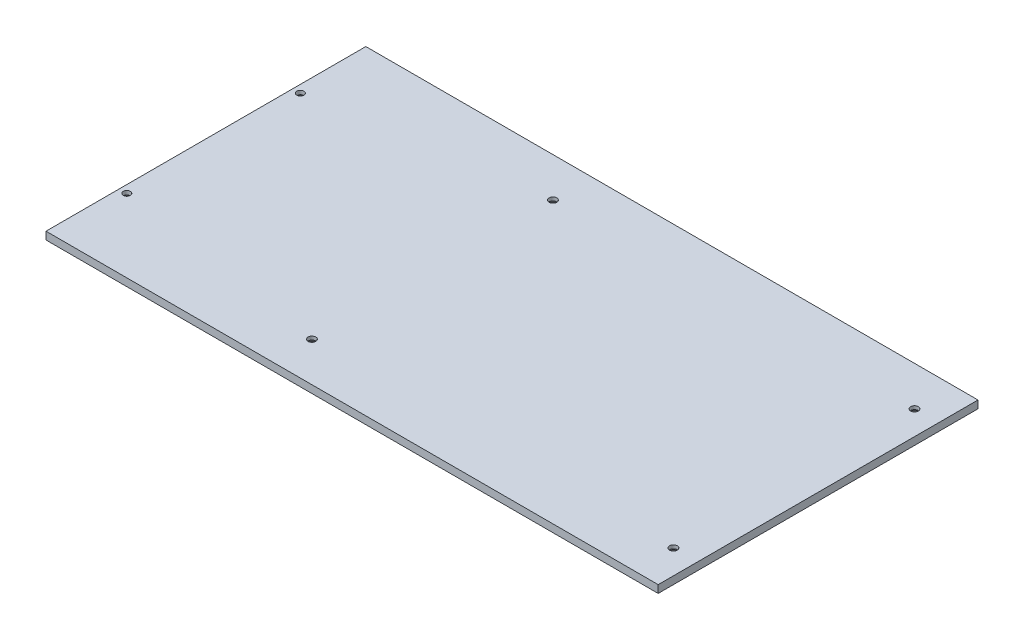
ISO-10303-21;
HEADER;
FILE_DESCRIPTION(('STEP AP214'),'2;1');
FILE_NAME('part.step','',(''),(''),'','','');
FILE_SCHEMA(('AUTOMOTIVE_DESIGN { 1 0 10303 214 1 1 1 1 }'));
ENDSEC;
DATA;
#1=APPLICATION_CONTEXT('core data for automotive mechanical design processes');
#2=APPLICATION_PROTOCOL_DEFINITION('international standard','automotive_design',2000,#1);
#3=PRODUCT_CONTEXT('',#1,'mechanical');
#4=PRODUCT('Part','Part','',(#3));
#5=PRODUCT_RELATED_PRODUCT_CATEGORY('part','',(#4));
#6=PRODUCT_DEFINITION_FORMATION('','',#4);
#7=PRODUCT_DEFINITION_CONTEXT('part definition',#1,'design');
#8=PRODUCT_DEFINITION('design','',#6,#7);
#9=PRODUCT_DEFINITION_SHAPE('','',#8);
#10=(LENGTH_UNIT() NAMED_UNIT(*) SI_UNIT(.MILLI.,.METRE.));
#11=(NAMED_UNIT(*) PLANE_ANGLE_UNIT() SI_UNIT($,.RADIAN.));
#12=(NAMED_UNIT(*) SI_UNIT($,.STERADIAN.) SOLID_ANGLE_UNIT());
#13=UNCERTAINTY_MEASURE_WITH_UNIT(LENGTH_MEASURE(1.E-05),#10,'distance_accuracy_value','');
#14=(GEOMETRIC_REPRESENTATION_CONTEXT(3) GLOBAL_UNCERTAINTY_ASSIGNED_CONTEXT((#13)) GLOBAL_UNIT_ASSIGNED_CONTEXT((#10,
#11,#12)) REPRESENTATION_CONTEXT('',''));
#15=CARTESIAN_POINT('',(0.,0.,0.));
#16=DIRECTION('',(0.,0.,1.));
#17=DIRECTION('',(1.,0.,0.));
#18=AXIS2_PLACEMENT_3D('',#15,#16,#17);
#19=CARTESIAN_POINT('',(0.,3.175,0.));
#20=DIRECTION('',(1.,0.,0.));
#21=DIRECTION('',(0.,0.,-1.));
#22=AXIS2_PLACEMENT_3D('',#19,#20,#21);
#23=PLANE('',#22);
#24=DIRECTION('',(0.,0.,1.));
#25=VECTOR('',#24,1.);
#26=CARTESIAN_POINT('',(0.,0.,0.));
#27=LINE('',#26,#25);
#28=CARTESIAN_POINT('',(0.,0.,-132.70000003));
#29=VERTEX_POINT('',#28);
#30=CARTESIAN_POINT('',(0.,0.,0.));
#31=VERTEX_POINT('',#30);
#32=EDGE_CURVE('E112',#29,#31,#27,.T.);
#33=ORIENTED_EDGE('',*,*,#32,.T.);
#34=DIRECTION('',(0.,-1.,0.));
#35=VECTOR('',#34,1.);
#36=CARTESIAN_POINT('',(0.,3.175,0.));
#37=LINE('',#36,#35);
#38=CARTESIAN_POINT('',(0.,3.175,0.));
#39=VERTEX_POINT('',#38);
#40=EDGE_CURVE('E11',#39,#31,#37,.T.);
#41=ORIENTED_EDGE('',*,*,#40,.F.);
#42=DIRECTION('',(0.,0.,1.));
#43=VECTOR('',#42,1.);
#44=CARTESIAN_POINT('',(0.,3.175,0.));
#45=LINE('',#44,#43);
#46=CARTESIAN_POINT('',(0.,3.175,-132.70000003));
#47=VERTEX_POINT('',#46);
#48=EDGE_CURVE('E99',#47,#39,#45,.T.);
#49=ORIENTED_EDGE('',*,*,#48,.F.);
#50=DIRECTION('',(0.,-1.,0.));
#51=VECTOR('',#50,1.);
#52=CARTESIAN_POINT('',(0.,3.175,-132.70000003));
#53=LINE('',#52,#51);
#54=EDGE_CURVE('E108',#47,#29,#53,.T.);
#55=ORIENTED_EDGE('',*,*,#54,.T.);
#56=EDGE_LOOP('',(#33,#41,#49,#55));
#57=FACE_BOUND('',#56,.T.);
#58=ADVANCED_FACE('F46',(#57),#23,.F.);
#59=CARTESIAN_POINT('',(0.,3.175,0.));
#60=DIRECTION('',(0.,0.,-1.));
#61=DIRECTION('',(-1.,0.,0.));
#62=AXIS2_PLACEMENT_3D('',#59,#60,#61);
#63=PLANE('',#62);
#64=DIRECTION('',(1.,0.,0.));
#65=VECTOR('',#64,1.);
#66=CARTESIAN_POINT('',(0.,0.,0.));
#67=LINE('',#66,#65);
#68=CARTESIAN_POINT('',(254.,0.,0.));
#69=VERTEX_POINT('',#68);
#70=EDGE_CURVE('E103',#31,#69,#67,.T.);
#71=ORIENTED_EDGE('',*,*,#70,.T.);
#72=DIRECTION('',(0.,-1.,0.));
#73=VECTOR('',#72,1.);
#74=CARTESIAN_POINT('',(254.,3.175,0.));
#75=LINE('',#74,#73);
#76=CARTESIAN_POINT('',(254.,3.175,0.));
#77=VERTEX_POINT('',#76);
#78=EDGE_CURVE('E55',#77,#69,#75,.T.);
#79=ORIENTED_EDGE('',*,*,#78,.F.);
#80=DIRECTION('',(1.,0.,0.));
#81=VECTOR('',#80,1.);
#82=CARTESIAN_POINT('',(0.,3.175,0.));
#83=LINE('',#82,#81);
#84=EDGE_CURVE('E94',#39,#77,#83,.T.);
#85=ORIENTED_EDGE('',*,*,#84,.F.);
#86=ORIENTED_EDGE('',*,*,#40,.T.);
#87=EDGE_LOOP('',(#71,#79,#85,#86));
#88=FACE_BOUND('',#87,.T.);
#89=ADVANCED_FACE('F102',(#88),#63,.F.);
#90=CARTESIAN_POINT('',(254.,3.175,0.));
#91=DIRECTION('',(-1.,0.,0.));
#92=DIRECTION('',(0.,0.,1.));
#93=AXIS2_PLACEMENT_3D('',#90,#91,#92);
#94=PLANE('',#93);
#95=DIRECTION('',(0.,0.,-1.));
#96=VECTOR('',#95,1.);
#97=CARTESIAN_POINT('',(254.,0.,0.));
#98=LINE('',#97,#96);
#99=CARTESIAN_POINT('',(254.,0.,-132.70000003));
#100=VERTEX_POINT('',#99);
#101=EDGE_CURVE('E81',#69,#100,#98,.T.);
#102=ORIENTED_EDGE('',*,*,#101,.T.);
#103=DIRECTION('',(0.,-1.,0.));
#104=VECTOR('',#103,1.);
#105=CARTESIAN_POINT('',(254.,3.175,-132.70000003));
#106=LINE('',#105,#104);
#107=CARTESIAN_POINT('',(254.,3.175,-132.70000003));
#108=VERTEX_POINT('',#107);
#109=EDGE_CURVE('E104',#108,#100,#106,.T.);
#110=ORIENTED_EDGE('',*,*,#109,.F.);
#111=DIRECTION('',(0.,0.,-1.));
#112=VECTOR('',#111,1.);
#113=CARTESIAN_POINT('',(254.,3.175,0.));
#114=LINE('',#113,#112);
#115=EDGE_CURVE('E97',#77,#108,#114,.T.);
#116=ORIENTED_EDGE('',*,*,#115,.F.);
#117=ORIENTED_EDGE('',*,*,#78,.T.);
#118=EDGE_LOOP('',(#102,#110,#116,#117));
#119=FACE_BOUND('',#118,.T.);
#120=ADVANCED_FACE('F106',(#119),#94,.F.);
#121=CARTESIAN_POINT('',(0.,3.175,-132.70000003));
#122=DIRECTION('',(0.,0.,1.));
#123=DIRECTION('',(1.,0.,0.));
#124=AXIS2_PLACEMENT_3D('',#121,#122,#123);
#125=PLANE('',#124);
#126=DIRECTION('',(-1.,0.,0.));
#127=VECTOR('',#126,1.);
#128=CARTESIAN_POINT('',(0.,0.,-132.70000003));
#129=LINE('',#128,#127);
#130=EDGE_CURVE('E87',#100,#29,#129,.T.);
#131=ORIENTED_EDGE('',*,*,#130,.T.);
#132=ORIENTED_EDGE('',*,*,#54,.F.);
#133=DIRECTION('',(-1.,0.,0.));
#134=VECTOR('',#133,1.);
#135=CARTESIAN_POINT('',(0.,3.175,-132.70000003));
#136=LINE('',#135,#134);
#137=EDGE_CURVE('E64',#108,#47,#136,.T.);
#138=ORIENTED_EDGE('',*,*,#137,.F.);
#139=ORIENTED_EDGE('',*,*,#109,.T.);
#140=EDGE_LOOP('',(#131,#132,#138,#139));
#141=FACE_BOUND('',#140,.T.);
#142=ADVANCED_FACE('F187',(#141),#125,.F.);
#143=CARTESIAN_POINT('',(0.,3.175,0.));
#144=DIRECTION('',(0.,-1.,0.));
#145=DIRECTION('',(0.,0.,-1.));
#146=AXIS2_PLACEMENT_3D('',#143,#144,#145);
#147=PLANE('',#146);
#148=CARTESIAN_POINT('',(3.17499999999969,3.175,-102.350000024));
#149=DIRECTION('',(0.,-1.,0.));
#150=DIRECTION('',(0.,0.,-1.));
#151=AXIS2_PLACEMENT_3D('',#148,#149,#150);
#152=CIRCLE('',#151,1.4732);
#153=CARTESIAN_POINT('',(3.17499999999969,3.175,-103.823200024));
#154=VERTEX_POINT('',#153);
#155=EDGE_CURVE('E49',#154,#154,#152,.T.);
#156=ORIENTED_EDGE('',*,*,#155,.T.);
#157=EDGE_LOOP('',(#156));
#158=FACE_BOUND('',#157,.T.);
#159=CARTESIAN_POINT('',(3.17499999999994,3.175,-30.350000006));
#160=DIRECTION('',(0.,-1.,0.));
#161=DIRECTION('',(0.,0.,-1.));
#162=AXIS2_PLACEMENT_3D('',#159,#160,#161);
#163=CIRCLE('',#162,1.4732);
#164=CARTESIAN_POINT('',(3.17499999999994,3.175,-31.823200006));
#165=VERTEX_POINT('',#164);
#166=EDGE_CURVE('E138',#165,#165,#163,.T.);
#167=ORIENTED_EDGE('',*,*,#166,.T.);
#168=EDGE_LOOP('',(#167));
#169=FACE_BOUND('',#168,.T.);
#170=CARTESIAN_POINT('',(244.,3.175,-116.350000015));
#171=DIRECTION('',(0.,-1.,0.));
#172=DIRECTION('',(0.,0.,-1.));
#173=AXIS2_PLACEMENT_3D('',#170,#171,#172);
#174=CIRCLE('',#173,1.59999999999999);
#175=CARTESIAN_POINT('',(244.,3.175,-117.950000015));
#176=VERTEX_POINT('',#175);
#177=EDGE_CURVE('E134',#176,#176,#174,.T.);
#178=ORIENTED_EDGE('',*,*,#177,.T.);
#179=EDGE_LOOP('',(#178));
#180=FACE_BOUND('',#179,.T.);
#181=CARTESIAN_POINT('',(94.,3.175,-116.350000015));
#182=DIRECTION('',(0.,-1.,0.));
#183=DIRECTION('',(0.,0.,-1.));
#184=AXIS2_PLACEMENT_3D('',#181,#182,#183);
#185=CIRCLE('',#184,1.6);
#186=CARTESIAN_POINT('',(94.,3.175,-117.950000015));
#187=VERTEX_POINT('',#186);
#188=EDGE_CURVE('E129',#187,#187,#185,.T.);
#189=ORIENTED_EDGE('',*,*,#188,.T.);
#190=EDGE_LOOP('',(#189));
#191=FACE_BOUND('',#190,.T.);
#192=CARTESIAN_POINT('',(94.,3.175,-16.350000015));
#193=DIRECTION('',(0.,-1.,0.));
#194=DIRECTION('',(0.,0.,-1.));
#195=AXIS2_PLACEMENT_3D('',#192,#193,#194);
#196=CIRCLE('',#195,1.6);
#197=CARTESIAN_POINT('',(94.,3.175,-17.950000015));
#198=VERTEX_POINT('',#197);
#199=EDGE_CURVE('E124',#198,#198,#196,.T.);
#200=ORIENTED_EDGE('',*,*,#199,.T.);
#201=EDGE_LOOP('',(#200));
#202=FACE_BOUND('',#201,.T.);
#203=CARTESIAN_POINT('',(244.,3.175,-16.350000015));
#204=DIRECTION('',(0.,-1.,0.));
#205=DIRECTION('',(0.,0.,-1.));
#206=AXIS2_PLACEMENT_3D('',#203,#204,#205);
#207=CIRCLE('',#206,1.59999999999999);
#208=CARTESIAN_POINT('',(244.,3.175,-17.950000015));
#209=VERTEX_POINT('',#208);
#210=EDGE_CURVE('E115',#209,#209,#207,.T.);
#211=ORIENTED_EDGE('',*,*,#210,.T.);
#212=EDGE_LOOP('',(#211));
#213=FACE_BOUND('',#212,.T.);
#214=ORIENTED_EDGE('',*,*,#48,.T.);
#215=ORIENTED_EDGE('',*,*,#84,.T.);
#216=ORIENTED_EDGE('',*,*,#115,.T.);
#217=ORIENTED_EDGE('',*,*,#137,.T.);
#218=EDGE_LOOP('',(#214,#215,#216,#217));
#219=FACE_BOUND('',#218,.T.);
#220=ADVANCED_FACE('F95',(#158,#169,#180,#191,#202,#213,#219),#147,.F.);
#221=CARTESIAN_POINT('',(0.,0.,0.));
#222=DIRECTION('',(0.,-1.,0.));
#223=DIRECTION('',(0.,0.,-1.));
#224=AXIS2_PLACEMENT_3D('',#221,#222,#223);
#225=PLANE('',#224);
#226=CARTESIAN_POINT('',(3.17499999999969,0.,-102.350000024));
#227=DIRECTION('',(0.,-1.,0.));
#228=DIRECTION('',(0.,0.,-1.));
#229=AXIS2_PLACEMENT_3D('',#226,#227,#228);
#230=CIRCLE('',#229,2.8575);
#231=CARTESIAN_POINT('',(3.17499999999969,0.,-105.207500024));
#232=VERTEX_POINT('',#231);
#233=EDGE_CURVE('E423',#232,#232,#230,.T.);
#234=ORIENTED_EDGE('',*,*,#233,.F.);
#235=EDGE_LOOP('',(#234));
#236=FACE_BOUND('',#235,.T.);
#237=CARTESIAN_POINT('',(3.17499999999994,0.,-30.350000006));
#238=DIRECTION('',(0.,-1.,0.));
#239=DIRECTION('',(0.,0.,-1.));
#240=AXIS2_PLACEMENT_3D('',#237,#238,#239);
#241=CIRCLE('',#240,2.8575);
#242=CARTESIAN_POINT('',(3.17499999999994,0.,-33.207500006));
#243=VERTEX_POINT('',#242);
#244=EDGE_CURVE('E147',#243,#243,#241,.T.);
#245=ORIENTED_EDGE('',*,*,#244,.F.);
#246=EDGE_LOOP('',(#245));
#247=FACE_BOUND('',#246,.T.);
#248=CARTESIAN_POINT('',(244.,0.,-116.350000015));
#249=DIRECTION('',(0.,-1.,0.));
#250=DIRECTION('',(0.,0.,-1.));
#251=AXIS2_PLACEMENT_3D('',#248,#249,#250);
#252=CIRCLE('',#251,3.36);
#253=CARTESIAN_POINT('',(244.,0.,-119.710000015));
#254=VERTEX_POINT('',#253);
#255=EDGE_CURVE('E140',#254,#254,#252,.T.);
#256=ORIENTED_EDGE('',*,*,#255,.F.);
#257=EDGE_LOOP('',(#256));
#258=FACE_BOUND('',#257,.T.);
#259=CARTESIAN_POINT('',(94.,0.,-116.350000015));
#260=DIRECTION('',(0.,-1.,0.));
#261=DIRECTION('',(0.,0.,-1.));
#262=AXIS2_PLACEMENT_3D('',#259,#260,#261);
#263=CIRCLE('',#262,3.36);
#264=CARTESIAN_POINT('',(94.,0.,-119.710000015));
#265=VERTEX_POINT('',#264);
#266=EDGE_CURVE('E136',#265,#265,#263,.T.);
#267=ORIENTED_EDGE('',*,*,#266,.F.);
#268=EDGE_LOOP('',(#267));
#269=FACE_BOUND('',#268,.T.);
#270=CARTESIAN_POINT('',(94.,0.,-16.350000015));
#271=DIRECTION('',(0.,-1.,0.));
#272=DIRECTION('',(0.,0.,-1.));
#273=AXIS2_PLACEMENT_3D('',#270,#271,#272);
#274=CIRCLE('',#273,3.36);
#275=CARTESIAN_POINT('',(94.,0.,-19.710000015));
#276=VERTEX_POINT('',#275);
#277=EDGE_CURVE('E132',#276,#276,#274,.T.);
#278=ORIENTED_EDGE('',*,*,#277,.F.);
#279=EDGE_LOOP('',(#278));
#280=FACE_BOUND('',#279,.T.);
#281=CARTESIAN_POINT('',(244.,0.,-16.350000015));
#282=DIRECTION('',(0.,-1.,0.));
#283=DIRECTION('',(0.,0.,-1.));
#284=AXIS2_PLACEMENT_3D('',#281,#282,#283);
#285=CIRCLE('',#284,3.36);
#286=CARTESIAN_POINT('',(244.,0.,-19.710000015));
#287=VERTEX_POINT('',#286);
#288=EDGE_CURVE('E127',#287,#287,#285,.T.);
#289=ORIENTED_EDGE('',*,*,#288,.F.);
#290=EDGE_LOOP('',(#289));
#291=FACE_BOUND('',#290,.T.);
#292=ORIENTED_EDGE('',*,*,#32,.F.);
#293=ORIENTED_EDGE('',*,*,#130,.F.);
#294=ORIENTED_EDGE('',*,*,#101,.F.);
#295=ORIENTED_EDGE('',*,*,#70,.F.);
#296=EDGE_LOOP('',(#292,#293,#294,#295));
#297=FACE_BOUND('',#296,.T.);
#298=ADVANCED_FACE('F180',(#236,#247,#258,#269,#280,#291,#297),#225,.T.);
#299=CARTESIAN_POINT('',(244.,0.,-16.350000015));
#300=DIRECTION('',(0.,-1.,0.));
#301=DIRECTION('',(0.,0.,-1.));
#302=AXIS2_PLACEMENT_3D('',#299,#300,#301);
#303=CYLINDRICAL_SURFACE('',#302,1.59999999999999);
#304=CARTESIAN_POINT('',(244.,1.76,-16.350000015));
#305=DIRECTION('',(0.,-1.,0.));
#306=DIRECTION('',(0.,0.,-1.));
#307=AXIS2_PLACEMENT_3D('',#304,#305,#306);
#308=CIRCLE('',#307,1.59999999999999);
#309=CARTESIAN_POINT('',(244.,1.76,-17.950000015));
#310=VERTEX_POINT('',#309);
#311=EDGE_CURVE('E123',#310,#310,#308,.T.);
#312=ORIENTED_EDGE('',*,*,#311,.T.);
#313=EDGE_LOOP('',(#312));
#314=FACE_BOUND('',#313,.T.);
#315=ORIENTED_EDGE('',*,*,#210,.F.);
#316=EDGE_LOOP('',(#315));
#317=FACE_BOUND('',#316,.T.);
#318=ADVANCED_FACE('F170',(#314,#317),#303,.F.);
#319=CARTESIAN_POINT('',(244.,0.,-16.350000015));
#320=DIRECTION('',(0.,-1.,0.));
#321=DIRECTION('',(0.,0.,-1.));
#322=AXIS2_PLACEMENT_3D('',#319,#320,#321);
#323=CONICAL_SURFACE('',#322,3.36,0.785398163397451);
#324=ORIENTED_EDGE('',*,*,#311,.F.);
#325=EDGE_LOOP('',(#324));
#326=FACE_BOUND('',#325,.T.);
#327=ORIENTED_EDGE('',*,*,#288,.T.);
#328=EDGE_LOOP('',(#327));
#329=FACE_BOUND('',#328,.T.);
#330=ADVANCED_FACE('F173',(#326,#329),#323,.F.);
#331=CARTESIAN_POINT('',(94.,0.,-16.350000015));
#332=DIRECTION('',(0.,-1.,0.));
#333=DIRECTION('',(0.,0.,-1.));
#334=AXIS2_PLACEMENT_3D('',#331,#332,#333);
#335=CYLINDRICAL_SURFACE('',#334,1.6);
#336=CARTESIAN_POINT('',(94.,1.76,-16.350000015));
#337=DIRECTION('',(0.,-1.,0.));
#338=DIRECTION('',(0.,0.,-1.));
#339=AXIS2_PLACEMENT_3D('',#336,#337,#338);
#340=CIRCLE('',#339,1.6);
#341=CARTESIAN_POINT('',(94.,1.76,-17.950000015));
#342=VERTEX_POINT('',#341);
#343=EDGE_CURVE('E128',#342,#342,#340,.T.);
#344=ORIENTED_EDGE('',*,*,#343,.T.);
#345=EDGE_LOOP('',(#344));
#346=FACE_BOUND('',#345,.T.);
#347=ORIENTED_EDGE('',*,*,#199,.F.);
#348=EDGE_LOOP('',(#347));
#349=FACE_BOUND('',#348,.T.);
#350=ADVANCED_FACE('F176',(#346,#349),#335,.F.);
#351=CARTESIAN_POINT('',(94.,0.,-16.350000015));
#352=DIRECTION('',(0.,-1.,0.));
#353=DIRECTION('',(0.,0.,-1.));
#354=AXIS2_PLACEMENT_3D('',#351,#352,#353);
#355=CONICAL_SURFACE('',#354,3.36,0.785398163397447);
#356=ORIENTED_EDGE('',*,*,#343,.F.);
#357=EDGE_LOOP('',(#356));
#358=FACE_BOUND('',#357,.T.);
#359=ORIENTED_EDGE('',*,*,#277,.T.);
#360=EDGE_LOOP('',(#359));
#361=FACE_BOUND('',#360,.T.);
#362=ADVANCED_FACE('F248',(#358,#361),#355,.F.);
#363=CARTESIAN_POINT('',(94.,0.,-116.350000015));
#364=DIRECTION('',(0.,-1.,0.));
#365=DIRECTION('',(0.,0.,-1.));
#366=AXIS2_PLACEMENT_3D('',#363,#364,#365);
#367=CYLINDRICAL_SURFACE('',#366,1.6);
#368=CARTESIAN_POINT('',(94.,1.76,-116.350000015));
#369=DIRECTION('',(0.,-1.,0.));
#370=DIRECTION('',(0.,0.,-1.));
#371=AXIS2_PLACEMENT_3D('',#368,#369,#370);
#372=CIRCLE('',#371,1.6);
#373=CARTESIAN_POINT('',(94.,1.76,-117.950000015));
#374=VERTEX_POINT('',#373);
#375=EDGE_CURVE('E133',#374,#374,#372,.T.);
#376=ORIENTED_EDGE('',*,*,#375,.T.);
#377=EDGE_LOOP('',(#376));
#378=FACE_BOUND('',#377,.T.);
#379=ORIENTED_EDGE('',*,*,#188,.F.);
#380=EDGE_LOOP('',(#379));
#381=FACE_BOUND('',#380,.T.);
#382=ADVANCED_FACE('F258',(#378,#381),#367,.F.);
#383=CARTESIAN_POINT('',(94.,0.,-116.350000015));
#384=DIRECTION('',(0.,-1.,0.));
#385=DIRECTION('',(0.,0.,-1.));
#386=AXIS2_PLACEMENT_3D('',#383,#384,#385);
#387=CONICAL_SURFACE('',#386,3.36,0.785398163397447);
#388=ORIENTED_EDGE('',*,*,#375,.F.);
#389=EDGE_LOOP('',(#388));
#390=FACE_BOUND('',#389,.T.);
#391=ORIENTED_EDGE('',*,*,#266,.T.);
#392=EDGE_LOOP('',(#391));
#393=FACE_BOUND('',#392,.T.);
#394=ADVANCED_FACE('F268',(#390,#393),#387,.F.);
#395=CARTESIAN_POINT('',(244.,0.,-116.350000015));
#396=DIRECTION('',(0.,-1.,0.));
#397=DIRECTION('',(0.,0.,-1.));
#398=AXIS2_PLACEMENT_3D('',#395,#396,#397);
#399=CYLINDRICAL_SURFACE('',#398,1.59999999999999);
#400=CARTESIAN_POINT('',(244.,1.76,-116.350000015));
#401=DIRECTION('',(0.,-1.,0.));
#402=DIRECTION('',(0.,0.,-1.));
#403=AXIS2_PLACEMENT_3D('',#400,#401,#402);
#404=CIRCLE('',#403,1.59999999999999);
#405=CARTESIAN_POINT('',(244.,1.76,-117.950000015));
#406=VERTEX_POINT('',#405);
#407=EDGE_CURVE('E137',#406,#406,#404,.T.);
#408=ORIENTED_EDGE('',*,*,#407,.T.);
#409=EDGE_LOOP('',(#408));
#410=FACE_BOUND('',#409,.T.);
#411=ORIENTED_EDGE('',*,*,#177,.F.);
#412=EDGE_LOOP('',(#411));
#413=FACE_BOUND('',#412,.T.);
#414=ADVANCED_FACE('F278',(#410,#413),#399,.F.);
#415=CARTESIAN_POINT('',(244.,0.,-116.350000015));
#416=DIRECTION('',(0.,-1.,0.));
#417=DIRECTION('',(0.,0.,-1.));
#418=AXIS2_PLACEMENT_3D('',#415,#416,#417);
#419=CONICAL_SURFACE('',#418,3.36,0.785398163397451);
#420=ORIENTED_EDGE('',*,*,#407,.F.);
#421=EDGE_LOOP('',(#420));
#422=FACE_BOUND('',#421,.T.);
#423=ORIENTED_EDGE('',*,*,#255,.T.);
#424=EDGE_LOOP('',(#423));
#425=FACE_BOUND('',#424,.T.);
#426=ADVANCED_FACE('F288',(#422,#425),#419,.F.);
#427=CARTESIAN_POINT('',(3.17499999999994,0.,-30.350000006));
#428=DIRECTION('',(0.,-1.,0.));
#429=DIRECTION('',(0.,0.,-1.));
#430=AXIS2_PLACEMENT_3D('',#427,#428,#429);
#431=CYLINDRICAL_SURFACE('',#430,1.4732);
#432=CARTESIAN_POINT('',(3.17499999999994,1.59245498611604,-30.350000006));
#433=DIRECTION('',(0.,-1.,0.));
#434=DIRECTION('',(0.,0.,-1.));
#435=AXIS2_PLACEMENT_3D('',#432,#433,#434);
#436=CIRCLE('',#435,1.4732);
#437=CARTESIAN_POINT('',(3.17499999999994,1.59245498611604,-31.823200006));
#438=VERTEX_POINT('',#437);
#439=EDGE_CURVE('E141',#438,#438,#436,.T.);
#440=ORIENTED_EDGE('',*,*,#439,.T.);
#441=EDGE_LOOP('',(#440));
#442=FACE_BOUND('',#441,.T.);
#443=ORIENTED_EDGE('',*,*,#166,.F.);
#444=EDGE_LOOP('',(#443));
#445=FACE_BOUND('',#444,.T.);
#446=ADVANCED_FACE('F297',(#442,#445),#431,.F.);
#447=CARTESIAN_POINT('',(3.17499999999994,0.,-30.350000006));
#448=DIRECTION('',(0.,-1.,0.));
#449=DIRECTION('',(0.,0.,-1.));
#450=AXIS2_PLACEMENT_3D('',#447,#448,#449);
#451=CONICAL_SURFACE('',#450,2.8575,0.715584993317676);
#452=ORIENTED_EDGE('',*,*,#439,.F.);
#453=EDGE_LOOP('',(#452));
#454=FACE_BOUND('',#453,.T.);
#455=ORIENTED_EDGE('',*,*,#244,.T.);
#456=EDGE_LOOP('',(#455));
#457=FACE_BOUND('',#456,.T.);
#458=ADVANCED_FACE('F306',(#454,#457),#451,.F.);
#459=CARTESIAN_POINT('',(3.17499999999969,0.,-102.350000024));
#460=DIRECTION('',(0.,-1.,0.));
#461=DIRECTION('',(0.,0.,-1.));
#462=AXIS2_PLACEMENT_3D('',#459,#460,#461);
#463=CYLINDRICAL_SURFACE('',#462,1.4732);
#464=CARTESIAN_POINT('',(3.17499999999969,1.59245498611604,-102.350000024));
#465=DIRECTION('',(0.,-1.,0.));
#466=DIRECTION('',(0.,0.,-1.));
#467=AXIS2_PLACEMENT_3D('',#464,#465,#466);
#468=CIRCLE('',#467,1.4732);
#469=CARTESIAN_POINT('',(3.17499999999969,1.59245498611604,-103.823200024));
#470=VERTEX_POINT('',#469);
#471=EDGE_CURVE('E420',#470,#470,#468,.T.);
#472=ORIENTED_EDGE('',*,*,#471,.T.);
#473=EDGE_LOOP('',(#472));
#474=FACE_BOUND('',#473,.T.);
#475=ORIENTED_EDGE('',*,*,#155,.F.);
#476=EDGE_LOOP('',(#475));
#477=FACE_BOUND('',#476,.T.);
#478=ADVANCED_FACE('F315',(#474,#477),#463,.F.);
#479=CARTESIAN_POINT('',(3.17499999999969,0.,-102.350000024));
#480=DIRECTION('',(0.,-1.,0.));
#481=DIRECTION('',(0.,0.,-1.));
#482=AXIS2_PLACEMENT_3D('',#479,#480,#481);
#483=CONICAL_SURFACE('',#482,2.8575,0.715584993317676);
#484=ORIENTED_EDGE('',*,*,#471,.F.);
#485=EDGE_LOOP('',(#484));
#486=FACE_BOUND('',#485,.T.);
#487=ORIENTED_EDGE('',*,*,#233,.T.);
#488=EDGE_LOOP('',(#487));
#489=FACE_BOUND('',#488,.T.);
#490=ADVANCED_FACE('F325',(#486,#489),#483,.F.);
#491=CLOSED_SHELL('',(#58,#89,#120,#142,#220,#298,#318,#330,#350,#362,#382,#394,#414,#426,#446,
#458,#478,#490));
#492=MANIFOLD_SOLID_BREP('B2',#491);
#493=ADVANCED_BREP_SHAPE_REPRESENTATION('',(#18,#492),#14);
#494=SHAPE_DEFINITION_REPRESENTATION(#9,#493);
ENDSEC;
END-ISO-10303-21;
